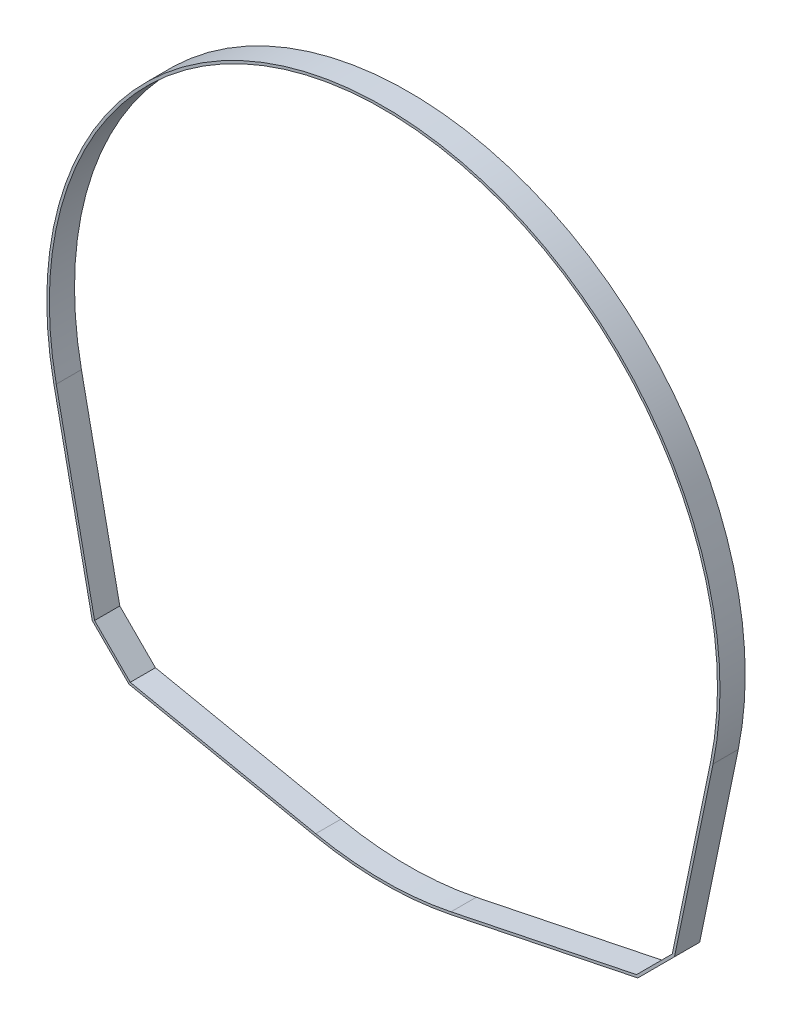
ISO-10303-21;
HEADER;
FILE_DESCRIPTION(('STEP AP214'),'2;1');
FILE_NAME('part.step','',(''),(''),'','','');
FILE_SCHEMA(('AUTOMOTIVE_DESIGN { 1 0 10303 214 1 1 1 1 }'));
ENDSEC;
DATA;
#1=APPLICATION_CONTEXT('core data for automotive mechanical design processes');
#2=APPLICATION_PROTOCOL_DEFINITION('international standard','automotive_design',2000,#1);
#3=PRODUCT_CONTEXT('',#1,'mechanical');
#4=PRODUCT('Part','Part','',(#3));
#5=PRODUCT_RELATED_PRODUCT_CATEGORY('part','',(#4));
#6=PRODUCT_DEFINITION_FORMATION('','',#4);
#7=PRODUCT_DEFINITION_CONTEXT('part definition',#1,'design');
#8=PRODUCT_DEFINITION('design','',#6,#7);
#9=PRODUCT_DEFINITION_SHAPE('','',#8);
#10=(LENGTH_UNIT() NAMED_UNIT(*) SI_UNIT(.MILLI.,.METRE.));
#11=(NAMED_UNIT(*) PLANE_ANGLE_UNIT() SI_UNIT($,.RADIAN.));
#12=(NAMED_UNIT(*) SI_UNIT($,.STERADIAN.) SOLID_ANGLE_UNIT());
#13=UNCERTAINTY_MEASURE_WITH_UNIT(LENGTH_MEASURE(1.E-05),#10,'distance_accuracy_value','');
#14=(GEOMETRIC_REPRESENTATION_CONTEXT(3) GLOBAL_UNCERTAINTY_ASSIGNED_CONTEXT((#13)) GLOBAL_UNIT_ASSIGNED_CONTEXT((#10,
#11,#12)) REPRESENTATION_CONTEXT('',''));
#15=CARTESIAN_POINT('',(0.,0.,0.));
#16=DIRECTION('',(0.,0.,1.));
#17=DIRECTION('',(1.,0.,0.));
#18=AXIS2_PLACEMENT_3D('',#15,#16,#17);
#19=CARTESIAN_POINT('',(0.,0.,6.35));
#20=DIRECTION('',(0.,0.,1.));
#21=DIRECTION('',(1.,0.,0.));
#22=AXIS2_PLACEMENT_3D('',#19,#20,#21);
#23=PLANE('',#22);
#24=DIRECTION('',(0.707106781186546,-0.707106781186549,0.));
#25=VECTOR('',#24,1.);
#26=CARTESIAN_POINT('',(-73.3180416406725,-64.0690698327725,6.35));
#27=LINE('',#26,#25);
#28=CARTESIAN_POINT('',(-73.3180416406725,-64.0690698327725,6.35));
#29=VERTEX_POINT('',#28);
#30=CARTESIAN_POINT('',(-64.0690698327726,-73.3180416406725,6.35));
#31=VERTEX_POINT('',#30);
#32=EDGE_CURVE('E245',#29,#31,#27,.T.);
#33=ORIENTED_EDGE('',*,*,#32,.T.);
#34=DIRECTION('',(0.979284564132644,-0.202488869944837,0.));
#35=VECTOR('',#34,1.);
#36=CARTESIAN_POINT('',(-64.0690698327726,-73.3180416406725,6.35));
#37=LINE('',#36,#35);
#38=CARTESIAN_POINT('',(-17.1654877273987,-83.0164007129346,6.35));
#39=VERTEX_POINT('',#38);
#40=EDGE_CURVE('E249',#31,#39,#37,.T.);
#41=ORIENTED_EDGE('',*,*,#40,.T.);
#42=CARTESIAN_POINT('',(0.,0.,6.35));
#43=DIRECTION('',(0.,0.,1.));
#44=DIRECTION('',(1.,0.,0.));
#45=AXIS2_PLACEMENT_3D('',#42,#43,#44);
#46=CIRCLE('',#45,84.7725);
#47=CARTESIAN_POINT('',(17.1654877273987,-83.0164007129346,6.35));
#48=VERTEX_POINT('',#47);
#49=EDGE_CURVE('E253',#39,#48,#46,.T.);
#50=ORIENTED_EDGE('',*,*,#49,.T.);
#51=DIRECTION('',(0.979284564132644,0.202488869944837,0.));
#52=VECTOR('',#51,1.);
#53=CARTESIAN_POINT('',(64.0690698327726,-73.3180416406725,6.35));
#54=LINE('',#53,#52);
#55=CARTESIAN_POINT('',(64.0690698327726,-73.3180416406725,6.35));
#56=VERTEX_POINT('',#55);
#57=EDGE_CURVE('E256',#48,#56,#54,.T.);
#58=ORIENTED_EDGE('',*,*,#57,.T.);
#59=DIRECTION('',(0.707106781186546,0.707106781186549,0.));
#60=VECTOR('',#59,1.);
#61=CARTESIAN_POINT('',(64.0690698327726,-73.3180416406725,6.35));
#62=LINE('',#61,#60);
#63=CARTESIAN_POINT('',(73.3180416406725,-64.0690698327726,6.35));
#64=VERTEX_POINT('',#63);
#65=EDGE_CURVE('E259',#56,#64,#62,.T.);
#66=ORIENTED_EDGE('',*,*,#65,.T.);
#67=DIRECTION('',(0.202488869944837,0.979284564132644,0.));
#68=VECTOR('',#67,1.);
#69=CARTESIAN_POINT('',(73.3180416406725,-64.0690698327726,6.35));
#70=LINE('',#69,#68);
#71=CARTESIAN_POINT('',(83.0164007129346,-17.1654877273987,6.35));
#72=VERTEX_POINT('',#71);
#73=EDGE_CURVE('E262',#64,#72,#70,.T.);
#74=ORIENTED_EDGE('',*,*,#73,.T.);
#75=CARTESIAN_POINT('',(0.,0.,6.35));
#76=DIRECTION('',(0.,0.,1.));
#77=DIRECTION('',(-1.,0.,0.));
#78=AXIS2_PLACEMENT_3D('',#75,#76,#77);
#79=CIRCLE('',#78,84.7725);
#80=CARTESIAN_POINT('',(-83.0164007129346,-17.1654877273987,6.35));
#81=VERTEX_POINT('',#80);
#82=EDGE_CURVE('E265',#72,#81,#79,.T.);
#83=ORIENTED_EDGE('',*,*,#82,.T.);
#84=DIRECTION('',(0.202488869944837,-0.979284564132644,0.));
#85=VECTOR('',#84,1.);
#86=CARTESIAN_POINT('',(-73.3180416406725,-64.0690698327725,6.35));
#87=LINE('',#86,#85);
#88=EDGE_CURVE('E268',#81,#29,#87,.T.);
#89=ORIENTED_EDGE('',*,*,#88,.T.);
#90=EDGE_LOOP('',(#33,#41,#50,#58,#66,#74,#83,#89));
#91=FACE_BOUND('',#90,.T.);
#92=DIRECTION('',(0.202488869944838,-0.979284564132644,0.));
#93=VECTOR('',#92,1.);
#94=CARTESIAN_POINT('',(-72.7346709912037,-63.7544148701345,6.35));
#95=LINE('',#94,#93);
#96=CARTESIAN_POINT('',(-82.3945550147104,-17.0369072949837,6.35));
#97=VERTEX_POINT('',#96);
#98=CARTESIAN_POINT('',(-72.7346709912037,-63.7544148701345,6.35));
#99=VERTEX_POINT('',#98);
#100=EDGE_CURVE('E165',#97,#99,#95,.T.);
#101=ORIENTED_EDGE('',*,*,#100,.F.);
#102=CARTESIAN_POINT('',(0.,0.,6.35));
#103=DIRECTION('',(0.,0.,1.));
#104=DIRECTION('',(-1.,0.,0.));
#105=AXIS2_PLACEMENT_3D('',#102,#103,#104);
#106=CIRCLE('',#105,84.1375);
#107=CARTESIAN_POINT('',(82.3945550147103,-17.0369072949837,6.35));
#108=VERTEX_POINT('',#107);
#109=EDGE_CURVE('E156',#108,#97,#106,.T.);
#110=ORIENTED_EDGE('',*,*,#109,.F.);
#111=DIRECTION('',(0.202488869944837,0.979284564132644,0.));
#112=VECTOR('',#111,1.);
#113=CARTESIAN_POINT('',(72.7346709912036,-63.7544148701345,6.35));
#114=LINE('',#113,#112);
#115=CARTESIAN_POINT('',(72.7346709912037,-63.7544148701345,6.35));
#116=VERTEX_POINT('',#115);
#117=EDGE_CURVE('E197',#116,#108,#114,.T.);
#118=ORIENTED_EDGE('',*,*,#117,.F.);
#119=DIRECTION('',(0.707106781186546,0.707106781186549,0.));
#120=VECTOR('',#119,1.);
#121=CARTESIAN_POINT('',(63.7544148701345,-72.7346709912037,6.35));
#122=LINE('',#121,#120);
#123=CARTESIAN_POINT('',(63.7544148701345,-72.7346709912037,6.35));
#124=VERTEX_POINT('',#123);
#125=EDGE_CURVE('E194',#124,#116,#122,.T.);
#126=ORIENTED_EDGE('',*,*,#125,.F.);
#127=DIRECTION('',(0.979284564132644,0.202488869944837,0.));
#128=VECTOR('',#127,1.);
#129=CARTESIAN_POINT('',(63.7544148701345,-72.7346709912037,6.35));
#130=LINE('',#129,#128);
#131=CARTESIAN_POINT('',(17.0369072949837,-82.3945550147104,6.35));
#132=VERTEX_POINT('',#131);
#133=EDGE_CURVE('E191',#132,#124,#130,.T.);
#134=ORIENTED_EDGE('',*,*,#133,.F.);
#135=CARTESIAN_POINT('',(0.,0.,6.35));
#136=DIRECTION('',(0.,0.,1.));
#137=DIRECTION('',(1.,0.,0.));
#138=AXIS2_PLACEMENT_3D('',#135,#136,#137);
#139=CIRCLE('',#138,84.1375);
#140=CARTESIAN_POINT('',(-17.0369072949837,-82.3945550147104,6.35));
#141=VERTEX_POINT('',#140);
#142=EDGE_CURVE('E188',#141,#132,#139,.T.);
#143=ORIENTED_EDGE('',*,*,#142,.F.);
#144=DIRECTION('',(0.979284564132644,-0.202488869944838,0.));
#145=VECTOR('',#144,1.);
#146=CARTESIAN_POINT('',(-63.7544148701345,-72.7346709912037,6.35));
#147=LINE('',#146,#145);
#148=CARTESIAN_POINT('',(-63.7544148701345,-72.7346709912037,6.35));
#149=VERTEX_POINT('',#148);
#150=EDGE_CURVE('E183',#149,#141,#147,.T.);
#151=ORIENTED_EDGE('',*,*,#150,.F.);
#152=DIRECTION('',(0.707106781186547,-0.707106781186548,0.));
#153=VECTOR('',#152,1.);
#154=CARTESIAN_POINT('',(-72.7346709912037,-63.7544148701345,6.35));
#155=LINE('',#154,#153);
#156=EDGE_CURVE('E179',#99,#149,#155,.T.);
#157=ORIENTED_EDGE('',*,*,#156,.F.);
#158=EDGE_LOOP('',(#101,#110,#118,#126,#134,#143,#151,#157));
#159=FACE_BOUND('',#158,.T.);
#160=ADVANCED_FACE('F42',(#91,#159),#23,.T.);
#161=CARTESIAN_POINT('',(0.,0.,0.));
#162=DIRECTION('',(0.,0.,1.));
#163=DIRECTION('',(1.,0.,0.));
#164=AXIS2_PLACEMENT_3D('',#161,#162,#163);
#165=PLANE('',#164);
#166=DIRECTION('',(0.707106781186546,-0.707106781186549,0.));
#167=VECTOR('',#166,1.);
#168=CARTESIAN_POINT('',(-73.3180416406725,-64.0690698327725,0.));
#169=LINE('',#168,#167);
#170=CARTESIAN_POINT('',(-73.3180416406725,-64.0690698327725,0.));
#171=VERTEX_POINT('',#170);
#172=CARTESIAN_POINT('',(-64.0690698327726,-73.3180416406725,0.));
#173=VERTEX_POINT('',#172);
#174=EDGE_CURVE('E174',#171,#173,#169,.T.);
#175=ORIENTED_EDGE('',*,*,#174,.F.);
#176=DIRECTION('',(0.202488869944837,-0.979284564132644,0.));
#177=VECTOR('',#176,1.);
#178=CARTESIAN_POINT('',(-73.3180416406725,-64.0690698327725,0.));
#179=LINE('',#178,#177);
#180=CARTESIAN_POINT('',(-83.0164007129346,-17.1654877273987,0.));
#181=VERTEX_POINT('',#180);
#182=EDGE_CURVE('E250',#181,#171,#179,.T.);
#183=ORIENTED_EDGE('',*,*,#182,.F.);
#184=CARTESIAN_POINT('',(0.,0.,0.));
#185=DIRECTION('',(0.,0.,1.));
#186=DIRECTION('',(-1.,0.,0.));
#187=AXIS2_PLACEMENT_3D('',#184,#185,#186);
#188=CIRCLE('',#187,84.7725);
#189=CARTESIAN_POINT('',(83.0164007129346,-17.1654877273987,0.));
#190=VERTEX_POINT('',#189);
#191=EDGE_CURVE('E290',#190,#181,#188,.T.);
#192=ORIENTED_EDGE('',*,*,#191,.F.);
#193=DIRECTION('',(0.202488869944837,0.979284564132644,0.));
#194=VECTOR('',#193,1.);
#195=CARTESIAN_POINT('',(73.3180416406725,-64.0690698327726,0.));
#196=LINE('',#195,#194);
#197=CARTESIAN_POINT('',(73.3180416406725,-64.0690698327726,0.));
#198=VERTEX_POINT('',#197);
#199=EDGE_CURVE('E287',#198,#190,#196,.T.);
#200=ORIENTED_EDGE('',*,*,#199,.F.);
#201=DIRECTION('',(0.707106781186546,0.707106781186549,0.));
#202=VECTOR('',#201,1.);
#203=CARTESIAN_POINT('',(64.0690698327726,-73.3180416406725,0.));
#204=LINE('',#203,#202);
#205=CARTESIAN_POINT('',(64.0690698327726,-73.3180416406725,0.));
#206=VERTEX_POINT('',#205);
#207=EDGE_CURVE('E284',#206,#198,#204,.T.);
#208=ORIENTED_EDGE('',*,*,#207,.F.);
#209=DIRECTION('',(0.979284564132644,0.202488869944837,0.));
#210=VECTOR('',#209,1.);
#211=CARTESIAN_POINT('',(64.0690698327726,-73.3180416406725,0.));
#212=LINE('',#211,#210);
#213=CARTESIAN_POINT('',(17.1654877273987,-83.0164007129346,0.));
#214=VERTEX_POINT('',#213);
#215=EDGE_CURVE('E281',#214,#206,#212,.T.);
#216=ORIENTED_EDGE('',*,*,#215,.F.);
#217=CARTESIAN_POINT('',(0.,0.,0.));
#218=DIRECTION('',(0.,0.,1.));
#219=DIRECTION('',(1.,0.,0.));
#220=AXIS2_PLACEMENT_3D('',#217,#218,#219);
#221=CIRCLE('',#220,84.7725);
#222=CARTESIAN_POINT('',(-17.1654877273987,-83.0164007129346,0.));
#223=VERTEX_POINT('',#222);
#224=EDGE_CURVE('E278',#223,#214,#221,.T.);
#225=ORIENTED_EDGE('',*,*,#224,.F.);
#226=DIRECTION('',(0.979284564132644,-0.202488869944837,0.));
#227=VECTOR('',#226,1.);
#228=CARTESIAN_POINT('',(-64.0690698327726,-73.3180416406725,0.));
#229=LINE('',#228,#227);
#230=EDGE_CURVE('E275',#173,#223,#229,.T.);
#231=ORIENTED_EDGE('',*,*,#230,.F.);
#232=EDGE_LOOP('',(#175,#183,#192,#200,#208,#216,#225,#231));
#233=FACE_BOUND('',#232,.T.);
#234=CARTESIAN_POINT('',(0.,0.,0.));
#235=DIRECTION('',(0.,0.,1.));
#236=DIRECTION('',(-1.,0.,0.));
#237=AXIS2_PLACEMENT_3D('',#234,#235,#236);
#238=CIRCLE('',#237,84.1375);
#239=CARTESIAN_POINT('',(82.3945550147103,-17.0369072949837,0.));
#240=VERTEX_POINT('',#239);
#241=CARTESIAN_POINT('',(-82.3945550147104,-17.0369072949837,0.));
#242=VERTEX_POINT('',#241);
#243=EDGE_CURVE('E66',#240,#242,#238,.T.);
#244=ORIENTED_EDGE('',*,*,#243,.T.);
#245=DIRECTION('',(0.202488869944838,-0.979284564132644,0.));
#246=VECTOR('',#245,1.);
#247=CARTESIAN_POINT('',(-72.7346709912037,-63.7544148701345,0.));
#248=LINE('',#247,#246);
#249=CARTESIAN_POINT('',(-72.7346709912037,-63.7544148701345,0.));
#250=VERTEX_POINT('',#249);
#251=EDGE_CURVE('E172',#242,#250,#248,.T.);
#252=ORIENTED_EDGE('',*,*,#251,.T.);
#253=DIRECTION('',(0.707106781186547,-0.707106781186548,0.));
#254=VECTOR('',#253,1.);
#255=CARTESIAN_POINT('',(-72.7346709912037,-63.7544148701345,0.));
#256=LINE('',#255,#254);
#257=CARTESIAN_POINT('',(-63.7544148701345,-72.7346709912037,0.));
#258=VERTEX_POINT('',#257);
#259=EDGE_CURVE('E204',#250,#258,#256,.T.);
#260=ORIENTED_EDGE('',*,*,#259,.T.);
#261=DIRECTION('',(0.979284564132644,-0.202488869944838,0.));
#262=VECTOR('',#261,1.);
#263=CARTESIAN_POINT('',(-63.7544148701345,-72.7346709912037,0.));
#264=LINE('',#263,#262);
#265=CARTESIAN_POINT('',(-17.0369072949837,-82.3945550147104,0.));
#266=VERTEX_POINT('',#265);
#267=EDGE_CURVE('E208',#258,#266,#264,.T.);
#268=ORIENTED_EDGE('',*,*,#267,.T.);
#269=CARTESIAN_POINT('',(0.,0.,0.));
#270=DIRECTION('',(0.,0.,1.));
#271=DIRECTION('',(1.,0.,0.));
#272=AXIS2_PLACEMENT_3D('',#269,#270,#271);
#273=CIRCLE('',#272,84.1375);
#274=CARTESIAN_POINT('',(17.0369072949837,-82.3945550147104,0.));
#275=VERTEX_POINT('',#274);
#276=EDGE_CURVE('E212',#266,#275,#273,.T.);
#277=ORIENTED_EDGE('',*,*,#276,.T.);
#278=DIRECTION('',(0.979284564132644,0.202488869944837,0.));
#279=VECTOR('',#278,1.);
#280=CARTESIAN_POINT('',(63.7544148701345,-72.7346709912037,0.));
#281=LINE('',#280,#279);
#282=CARTESIAN_POINT('',(63.7544148701345,-72.7346709912037,0.));
#283=VERTEX_POINT('',#282);
#284=EDGE_CURVE('E216',#275,#283,#281,.T.);
#285=ORIENTED_EDGE('',*,*,#284,.T.);
#286=DIRECTION('',(0.707106781186546,0.707106781186549,0.));
#287=VECTOR('',#286,1.);
#288=CARTESIAN_POINT('',(63.7544148701345,-72.7346709912037,0.));
#289=LINE('',#288,#287);
#290=CARTESIAN_POINT('',(72.7346709912036,-63.7544148701345,0.));
#291=VERTEX_POINT('',#290);
#292=EDGE_CURVE('E220',#283,#291,#289,.T.);
#293=ORIENTED_EDGE('',*,*,#292,.T.);
#294=DIRECTION('',(0.202488869944837,0.979284564132644,0.));
#295=VECTOR('',#294,1.);
#296=CARTESIAN_POINT('',(72.7346709912036,-63.7544148701345,0.));
#297=LINE('',#296,#295);
#298=EDGE_CURVE('E166',#291,#240,#297,.T.);
#299=ORIENTED_EDGE('',*,*,#298,.T.);
#300=EDGE_LOOP('',(#244,#252,#260,#268,#277,#285,#293,#299));
#301=FACE_BOUND('',#300,.T.);
#302=ADVANCED_FACE('F329',(#233,#301),#165,.F.);
#303=CARTESIAN_POINT('',(-73.3180416406725,-64.0690698327725,6.35));
#304=DIRECTION('',(0.707106781186549,0.707106781186546,0.));
#305=DIRECTION('',(-0.707106781186546,0.707106781186549,0.));
#306=AXIS2_PLACEMENT_3D('',#303,#304,#305);
#307=PLANE('',#306);
#308=ORIENTED_EDGE('',*,*,#174,.T.);
#309=DIRECTION('',(0.,0.,-1.));
#310=VECTOR('',#309,1.);
#311=CARTESIAN_POINT('',(-64.0690698327726,-73.3180416406725,6.35));
#312=LINE('',#311,#310);
#313=EDGE_CURVE('E11',#31,#173,#312,.T.);
#314=ORIENTED_EDGE('',*,*,#313,.F.);
#315=ORIENTED_EDGE('',*,*,#32,.F.);
#316=DIRECTION('',(0.,0.,-1.));
#317=VECTOR('',#316,1.);
#318=CARTESIAN_POINT('',(-73.3180416406725,-64.0690698327725,6.35));
#319=LINE('',#318,#317);
#320=EDGE_CURVE('E271',#29,#171,#319,.T.);
#321=ORIENTED_EDGE('',*,*,#320,.T.);
#322=EDGE_LOOP('',(#308,#314,#315,#321));
#323=FACE_BOUND('',#322,.T.);
#324=ADVANCED_FACE('F44',(#323),#307,.F.);
#325=CARTESIAN_POINT('',(-64.0690698327726,-73.3180416406725,6.35));
#326=DIRECTION('',(0.202488869944837,0.979284564132644,0.));
#327=DIRECTION('',(-0.979284564132644,0.202488869944837,0.));
#328=AXIS2_PLACEMENT_3D('',#325,#326,#327);
#329=PLANE('',#328);
#330=ORIENTED_EDGE('',*,*,#230,.T.);
#331=DIRECTION('',(0.,0.,-1.));
#332=VECTOR('',#331,1.);
#333=CARTESIAN_POINT('',(-17.1654877273987,-83.0164007129346,6.35));
#334=LINE('',#333,#332);
#335=EDGE_CURVE('E51',#39,#223,#334,.T.);
#336=ORIENTED_EDGE('',*,*,#335,.F.);
#337=ORIENTED_EDGE('',*,*,#40,.F.);
#338=ORIENTED_EDGE('',*,*,#313,.T.);
#339=EDGE_LOOP('',(#330,#336,#337,#338));
#340=FACE_BOUND('',#339,.T.);
#341=ADVANCED_FACE('F346',(#340),#329,.F.);
#342=CARTESIAN_POINT('',(0.,0.,6.35));
#343=DIRECTION('',(0.,0.,-1.));
#344=DIRECTION('',(-1.,0.,0.));
#345=AXIS2_PLACEMENT_3D('',#342,#343,#344);
#346=CYLINDRICAL_SURFACE('',#345,84.7725);
#347=ORIENTED_EDGE('',*,*,#224,.T.);
#348=DIRECTION('',(0.,0.,-1.));
#349=VECTOR('',#348,1.);
#350=CARTESIAN_POINT('',(17.1654877273987,-83.0164007129346,6.35));
#351=LINE('',#350,#349);
#352=EDGE_CURVE('E314',#48,#214,#351,.T.);
#353=ORIENTED_EDGE('',*,*,#352,.F.);
#354=ORIENTED_EDGE('',*,*,#49,.F.);
#355=ORIENTED_EDGE('',*,*,#335,.T.);
#356=EDGE_LOOP('',(#347,#353,#354,#355));
#357=FACE_BOUND('',#356,.T.);
#358=ADVANCED_FACE('F323',(#357),#346,.T.);
#359=CARTESIAN_POINT('',(64.0690698327726,-73.3180416406725,6.35));
#360=DIRECTION('',(-0.202488869944837,0.979284564132644,0.));
#361=DIRECTION('',(-0.979284564132644,-0.202488869944837,0.));
#362=AXIS2_PLACEMENT_3D('',#359,#360,#361);
#363=PLANE('',#362);
#364=ORIENTED_EDGE('',*,*,#215,.T.);
#365=DIRECTION('',(0.,0.,-1.));
#366=VECTOR('',#365,1.);
#367=CARTESIAN_POINT('',(64.0690698327726,-73.3180416406725,6.35));
#368=LINE('',#367,#366);
#369=EDGE_CURVE('E310',#56,#206,#368,.T.);
#370=ORIENTED_EDGE('',*,*,#369,.F.);
#371=ORIENTED_EDGE('',*,*,#57,.F.);
#372=ORIENTED_EDGE('',*,*,#352,.T.);
#373=EDGE_LOOP('',(#364,#370,#371,#372));
#374=FACE_BOUND('',#373,.T.);
#375=ADVANCED_FACE('F335',(#374),#363,.F.);
#376=CARTESIAN_POINT('',(64.0690698327726,-73.3180416406725,6.35));
#377=DIRECTION('',(-0.707106781186549,0.707106781186546,0.));
#378=DIRECTION('',(-0.707106781186546,-0.707106781186549,0.));
#379=AXIS2_PLACEMENT_3D('',#376,#377,#378);
#380=PLANE('',#379);
#381=ORIENTED_EDGE('',*,*,#207,.T.);
#382=DIRECTION('',(0.,0.,-1.));
#383=VECTOR('',#382,1.);
#384=CARTESIAN_POINT('',(73.3180416406725,-64.0690698327726,6.35));
#385=LINE('',#384,#383);
#386=EDGE_CURVE('E306',#64,#198,#385,.T.);
#387=ORIENTED_EDGE('',*,*,#386,.F.);
#388=ORIENTED_EDGE('',*,*,#65,.F.);
#389=ORIENTED_EDGE('',*,*,#369,.T.);
#390=EDGE_LOOP('',(#381,#387,#388,#389));
#391=FACE_BOUND('',#390,.T.);
#392=ADVANCED_FACE('F339',(#391),#380,.F.);
#393=CARTESIAN_POINT('',(73.3180416406725,-64.0690698327726,6.35));
#394=DIRECTION('',(-0.979284564132644,0.202488869944837,0.));
#395=DIRECTION('',(-0.202488869944837,-0.979284564132644,0.));
#396=AXIS2_PLACEMENT_3D('',#393,#394,#395);
#397=PLANE('',#396);
#398=ORIENTED_EDGE('',*,*,#199,.T.);
#399=DIRECTION('',(0.,0.,-1.));
#400=VECTOR('',#399,1.);
#401=CARTESIAN_POINT('',(83.0164007129346,-17.1654877273987,6.35));
#402=LINE('',#401,#400);
#403=EDGE_CURVE('E302',#72,#190,#402,.T.);
#404=ORIENTED_EDGE('',*,*,#403,.F.);
#405=ORIENTED_EDGE('',*,*,#73,.F.);
#406=ORIENTED_EDGE('',*,*,#386,.T.);
#407=EDGE_LOOP('',(#398,#404,#405,#406));
#408=FACE_BOUND('',#407,.T.);
#409=ADVANCED_FACE('F359',(#408),#397,.F.);
#410=CARTESIAN_POINT('',(0.,0.,6.35));
#411=DIRECTION('',(0.,0.,-1.));
#412=DIRECTION('',(-1.,0.,0.));
#413=AXIS2_PLACEMENT_3D('',#410,#411,#412);
#414=CYLINDRICAL_SURFACE('',#413,84.7725);
#415=ORIENTED_EDGE('',*,*,#191,.T.);
#416=DIRECTION('',(0.,0.,-1.));
#417=VECTOR('',#416,1.);
#418=CARTESIAN_POINT('',(-83.0164007129346,-17.1654877273987,6.35));
#419=LINE('',#418,#417);
#420=EDGE_CURVE('E298',#81,#181,#419,.T.);
#421=ORIENTED_EDGE('',*,*,#420,.F.);
#422=ORIENTED_EDGE('',*,*,#82,.F.);
#423=ORIENTED_EDGE('',*,*,#403,.T.);
#424=EDGE_LOOP('',(#415,#421,#422,#423));
#425=FACE_BOUND('',#424,.T.);
#426=ADVANCED_FACE('F357',(#425),#414,.T.);
#427=CARTESIAN_POINT('',(-73.3180416406725,-64.0690698327725,6.35));
#428=DIRECTION('',(0.979284564132644,0.202488869944837,0.));
#429=DIRECTION('',(-0.202488869944837,0.979284564132644,0.));
#430=AXIS2_PLACEMENT_3D('',#427,#428,#429);
#431=PLANE('',#430);
#432=ORIENTED_EDGE('',*,*,#182,.T.);
#433=ORIENTED_EDGE('',*,*,#320,.F.);
#434=ORIENTED_EDGE('',*,*,#88,.F.);
#435=ORIENTED_EDGE('',*,*,#420,.T.);
#436=EDGE_LOOP('',(#432,#433,#434,#435));
#437=FACE_BOUND('',#436,.T.);
#438=ADVANCED_FACE('F352',(#437),#431,.F.);
#439=CARTESIAN_POINT('',(0.,0.,6.35));
#440=DIRECTION('',(0.,0.,-1.));
#441=DIRECTION('',(-1.,0.,0.));
#442=AXIS2_PLACEMENT_3D('',#439,#440,#441);
#443=CYLINDRICAL_SURFACE('',#442,84.1375);
#444=ORIENTED_EDGE('',*,*,#243,.F.);
#445=DIRECTION('',(0.,0.,-1.));
#446=VECTOR('',#445,1.);
#447=CARTESIAN_POINT('',(82.3945550147103,-17.0369072949837,6.35));
#448=LINE('',#447,#446);
#449=EDGE_CURVE('E160',#108,#240,#448,.T.);
#450=ORIENTED_EDGE('',*,*,#449,.F.);
#451=ORIENTED_EDGE('',*,*,#109,.T.);
#452=DIRECTION('',(0.,0.,-1.));
#453=VECTOR('',#452,1.);
#454=CARTESIAN_POINT('',(-82.3945550147104,-17.0369072949837,6.35));
#455=LINE('',#454,#453);
#456=EDGE_CURVE('E159',#97,#242,#455,.T.);
#457=ORIENTED_EDGE('',*,*,#456,.T.);
#458=EDGE_LOOP('',(#444,#450,#451,#457));
#459=FACE_BOUND('',#458,.T.);
#460=ADVANCED_FACE('F158',(#459),#443,.F.);
#461=CARTESIAN_POINT('',(-72.7346709912037,-63.7544148701345,6.35));
#462=DIRECTION('',(0.979284564132644,0.202488869944838,0.));
#463=DIRECTION('',(-0.202488869944838,0.979284564132644,0.));
#464=AXIS2_PLACEMENT_3D('',#461,#462,#463);
#465=PLANE('',#464);
#466=ORIENTED_EDGE('',*,*,#251,.F.);
#467=ORIENTED_EDGE('',*,*,#456,.F.);
#468=ORIENTED_EDGE('',*,*,#100,.T.);
#469=DIRECTION('',(0.,0.,-1.));
#470=VECTOR('',#469,1.);
#471=CARTESIAN_POINT('',(-72.7346709912037,-63.7544148701345,6.35));
#472=LINE('',#471,#470);
#473=EDGE_CURVE('E175',#99,#250,#472,.T.);
#474=ORIENTED_EDGE('',*,*,#473,.T.);
#475=EDGE_LOOP('',(#466,#467,#468,#474));
#476=FACE_BOUND('',#475,.T.);
#477=ADVANCED_FACE('F169',(#476),#465,.T.);
#478=CARTESIAN_POINT('',(-72.7346709912037,-63.7544148701345,6.35));
#479=DIRECTION('',(0.707106781186548,0.707106781186547,0.));
#480=DIRECTION('',(-0.707106781186547,0.707106781186548,0.));
#481=AXIS2_PLACEMENT_3D('',#478,#479,#480);
#482=PLANE('',#481);
#483=ORIENTED_EDGE('',*,*,#259,.F.);
#484=ORIENTED_EDGE('',*,*,#473,.F.);
#485=ORIENTED_EDGE('',*,*,#156,.T.);
#486=DIRECTION('',(0.,0.,-1.));
#487=VECTOR('',#486,1.);
#488=CARTESIAN_POINT('',(-63.7544148701345,-72.7346709912037,6.35));
#489=LINE('',#488,#487);
#490=EDGE_CURVE('E240',#149,#258,#489,.T.);
#491=ORIENTED_EDGE('',*,*,#490,.T.);
#492=EDGE_LOOP('',(#483,#484,#485,#491));
#493=FACE_BOUND('',#492,.T.);
#494=ADVANCED_FACE('F384',(#493),#482,.T.);
#495=CARTESIAN_POINT('',(-63.7544148701345,-72.7346709912037,6.35));
#496=DIRECTION('',(0.202488869944838,0.979284564132644,0.));
#497=DIRECTION('',(-0.979284564132644,0.202488869944838,0.));
#498=AXIS2_PLACEMENT_3D('',#495,#496,#497);
#499=PLANE('',#498);
#500=ORIENTED_EDGE('',*,*,#267,.F.);
#501=ORIENTED_EDGE('',*,*,#490,.F.);
#502=ORIENTED_EDGE('',*,*,#150,.T.);
#503=DIRECTION('',(0.,0.,-1.));
#504=VECTOR('',#503,1.);
#505=CARTESIAN_POINT('',(-17.0369072949837,-82.3945550147104,6.35));
#506=LINE('',#505,#504);
#507=EDGE_CURVE('E237',#141,#266,#506,.T.);
#508=ORIENTED_EDGE('',*,*,#507,.T.);
#509=EDGE_LOOP('',(#500,#501,#502,#508));
#510=FACE_BOUND('',#509,.T.);
#511=ADVANCED_FACE('F388',(#510),#499,.T.);
#512=CARTESIAN_POINT('',(0.,0.,6.35));
#513=DIRECTION('',(0.,0.,-1.));
#514=DIRECTION('',(-1.,0.,0.));
#515=AXIS2_PLACEMENT_3D('',#512,#513,#514);
#516=CYLINDRICAL_SURFACE('',#515,84.1375);
#517=ORIENTED_EDGE('',*,*,#276,.F.);
#518=ORIENTED_EDGE('',*,*,#507,.F.);
#519=ORIENTED_EDGE('',*,*,#142,.T.);
#520=DIRECTION('',(0.,0.,-1.));
#521=VECTOR('',#520,1.);
#522=CARTESIAN_POINT('',(17.0369072949837,-82.3945550147104,6.35));
#523=LINE('',#522,#521);
#524=EDGE_CURVE('E234',#132,#275,#523,.T.);
#525=ORIENTED_EDGE('',*,*,#524,.T.);
#526=EDGE_LOOP('',(#517,#518,#519,#525));
#527=FACE_BOUND('',#526,.T.);
#528=ADVANCED_FACE('F394',(#527),#516,.F.);
#529=CARTESIAN_POINT('',(63.7544148701345,-72.7346709912037,6.35));
#530=DIRECTION('',(-0.202488869944837,0.979284564132644,0.));
#531=DIRECTION('',(-0.979284564132644,-0.202488869944837,0.));
#532=AXIS2_PLACEMENT_3D('',#529,#530,#531);
#533=PLANE('',#532);
#534=ORIENTED_EDGE('',*,*,#284,.F.);
#535=ORIENTED_EDGE('',*,*,#524,.F.);
#536=ORIENTED_EDGE('',*,*,#133,.T.);
#537=DIRECTION('',(0.,0.,-1.));
#538=VECTOR('',#537,1.);
#539=CARTESIAN_POINT('',(63.7544148701345,-72.7346709912037,6.35));
#540=LINE('',#539,#538);
#541=EDGE_CURVE('E231',#124,#283,#540,.T.);
#542=ORIENTED_EDGE('',*,*,#541,.T.);
#543=EDGE_LOOP('',(#534,#535,#536,#542));
#544=FACE_BOUND('',#543,.T.);
#545=ADVANCED_FACE('F398',(#544),#533,.T.);
#546=CARTESIAN_POINT('',(63.7544148701345,-72.7346709912037,6.35));
#547=DIRECTION('',(-0.707106781186549,0.707106781186546,0.));
#548=DIRECTION('',(-0.707106781186546,-0.707106781186549,0.));
#549=AXIS2_PLACEMENT_3D('',#546,#547,#548);
#550=PLANE('',#549);
#551=ORIENTED_EDGE('',*,*,#292,.F.);
#552=ORIENTED_EDGE('',*,*,#541,.F.);
#553=ORIENTED_EDGE('',*,*,#125,.T.);
#554=DIRECTION('',(0.,0.,-1.));
#555=VECTOR('',#554,1.);
#556=CARTESIAN_POINT('',(72.7346709912036,-63.7544148701345,6.35));
#557=LINE('',#556,#555);
#558=EDGE_CURVE('E58',#116,#291,#557,.T.);
#559=ORIENTED_EDGE('',*,*,#558,.T.);
#560=EDGE_LOOP('',(#551,#552,#553,#559));
#561=FACE_BOUND('',#560,.T.);
#562=ADVANCED_FACE('F402',(#561),#550,.T.);
#563=CARTESIAN_POINT('',(72.7346709912036,-63.7544148701345,6.35));
#564=DIRECTION('',(-0.979284564132644,0.202488869944837,0.));
#565=DIRECTION('',(-0.202488869944837,-0.979284564132644,0.));
#566=AXIS2_PLACEMENT_3D('',#563,#564,#565);
#567=PLANE('',#566);
#568=ORIENTED_EDGE('',*,*,#298,.F.);
#569=ORIENTED_EDGE('',*,*,#558,.F.);
#570=ORIENTED_EDGE('',*,*,#117,.T.);
#571=ORIENTED_EDGE('',*,*,#449,.T.);
#572=EDGE_LOOP('',(#568,#569,#570,#571));
#573=FACE_BOUND('',#572,.T.);
#574=ADVANCED_FACE('F406',(#573),#567,.T.);
#575=CLOSED_SHELL('',(#160,#302,#324,#341,#358,#375,#392,#409,#426,#438,#460,#477,#494,#511,
#528,#545,#562,#574));
#576=MANIFOLD_SOLID_BREP('B2',#575);
#577=ADVANCED_BREP_SHAPE_REPRESENTATION('',(#18,#576),#14);
#578=SHAPE_DEFINITION_REPRESENTATION(#9,#577);
ENDSEC;
END-ISO-10303-21;
